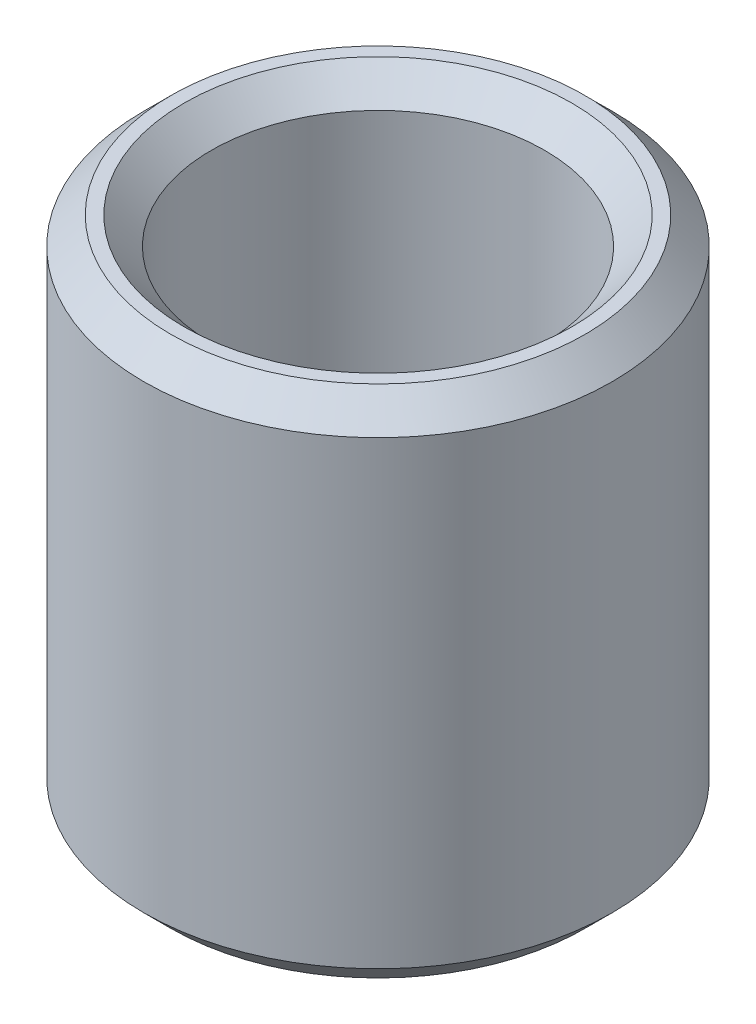
ISO-10303-21;
HEADER;
FILE_DESCRIPTION(('STEP AP214'),'2;1');
FILE_NAME('part.step','',(''),(''),'','','');
FILE_SCHEMA(('AUTOMOTIVE_DESIGN { 1 0 10303 214 1 1 1 1 }'));
ENDSEC;
DATA;
#1=APPLICATION_CONTEXT('core data for automotive mechanical design processes');
#2=APPLICATION_PROTOCOL_DEFINITION('international standard','automotive_design',2000,#1);
#3=PRODUCT_CONTEXT('',#1,'mechanical');
#4=PRODUCT('Part','Part','',(#3));
#5=PRODUCT_RELATED_PRODUCT_CATEGORY('part','',(#4));
#6=PRODUCT_DEFINITION_FORMATION('','',#4);
#7=PRODUCT_DEFINITION_CONTEXT('part definition',#1,'design');
#8=PRODUCT_DEFINITION('design','',#6,#7);
#9=PRODUCT_DEFINITION_SHAPE('','',#8);
#10=(LENGTH_UNIT() NAMED_UNIT(*) SI_UNIT(.MILLI.,.METRE.));
#11=(NAMED_UNIT(*) PLANE_ANGLE_UNIT() SI_UNIT($,.RADIAN.));
#12=(NAMED_UNIT(*) SI_UNIT($,.STERADIAN.) SOLID_ANGLE_UNIT());
#13=UNCERTAINTY_MEASURE_WITH_UNIT(LENGTH_MEASURE(1.E-05),#10,'distance_accuracy_value','');
#14=(GEOMETRIC_REPRESENTATION_CONTEXT(3) GLOBAL_UNCERTAINTY_ASSIGNED_CONTEXT((#13)) GLOBAL_UNIT_ASSIGNED_CONTEXT((#10,
#11,#12)) REPRESENTATION_CONTEXT('',''));
#15=CARTESIAN_POINT('',(0.,0.,0.));
#16=DIRECTION('',(0.,0.,1.));
#17=DIRECTION('',(1.,0.,0.));
#18=AXIS2_PLACEMENT_3D('',#15,#16,#17);
#19=CARTESIAN_POINT('',(0.,21.9595658767207,0.));
#20=DIRECTION('',(0.,-1.,0.));
#21=DIRECTION('',(0.,0.,-1.));
#22=AXIS2_PLACEMENT_3D('',#19,#20,#21);
#23=CYLINDRICAL_SURFACE('',#22,10.);
#24=CARTESIAN_POINT('',(0.,1.16347628392544,0.));
#25=DIRECTION('',(0.,1.,0.));
#26=DIRECTION('',(0.,0.,1.));
#27=AXIS2_PLACEMENT_3D('',#24,#25,#26);
#28=CIRCLE('',#27,10.);
#29=CARTESIAN_POINT('',(0.,1.16347628392544,10.));
#30=VERTEX_POINT('',#29);
#31=EDGE_CURVE('E10',#30,#30,#28,.T.);
#32=ORIENTED_EDGE('',*,*,#31,.T.);
#33=EDGE_LOOP('',(#32));
#34=FACE_BOUND('',#33,.T.);
#35=CARTESIAN_POINT('',(0.,20.7960895927952,0.));
#36=DIRECTION('',(0.,1.,0.));
#37=DIRECTION('',(0.,0.,1.));
#38=AXIS2_PLACEMENT_3D('',#35,#36,#37);
#39=CIRCLE('',#38,10.);
#40=CARTESIAN_POINT('',(0.,20.7960895927952,10.));
#41=VERTEX_POINT('',#40);
#42=EDGE_CURVE('E50',#41,#41,#39,.F.);
#43=ORIENTED_EDGE('',*,*,#42,.T.);
#44=EDGE_LOOP('',(#43));
#45=FACE_BOUND('',#44,.T.);
#46=ADVANCED_FACE('F39',(#34,#45),#23,.T.);
#47=CARTESIAN_POINT('',(0.,21.9595658767207,0.));
#48=DIRECTION('',(0.,1.,0.));
#49=DIRECTION('',(0.,0.,1.));
#50=AXIS2_PLACEMENT_3D('',#47,#48,#49);
#51=PLANE('',#50);
#52=CARTESIAN_POINT('',(0.,21.9595658767207,0.));
#53=DIRECTION('',(0.,1.,0.));
#54=DIRECTION('',(0.,0.,1.));
#55=AXIS2_PLACEMENT_3D('',#52,#53,#54);
#56=CIRCLE('',#55,8.27574237069555);
#57=CARTESIAN_POINT('',(0.,21.9595658767207,8.27574237069555));
#58=VERTEX_POINT('',#57);
#59=EDGE_CURVE('E58',#58,#58,#56,.F.);
#60=ORIENTED_EDGE('',*,*,#59,.T.);
#61=EDGE_LOOP('',(#60));
#62=FACE_BOUND('',#61,.T.);
#63=CARTESIAN_POINT('',(0.,21.9595658767207,0.));
#64=DIRECTION('',(0.,1.,0.));
#65=DIRECTION('',(0.,0.,1.));
#66=AXIS2_PLACEMENT_3D('',#63,#64,#65);
#67=CIRCLE('',#66,8.83652371607456);
#68=CARTESIAN_POINT('',(0.,21.9595658767207,8.83652371607456));
#69=VERTEX_POINT('',#68);
#70=EDGE_CURVE('E61',#69,#69,#67,.T.);
#71=ORIENTED_EDGE('',*,*,#70,.T.);
#72=EDGE_LOOP('',(#71));
#73=FACE_BOUND('',#72,.T.);
#74=ADVANCED_FACE('F88',(#62,#73),#51,.T.);
#75=CARTESIAN_POINT('',(0.,0.,0.));
#76=DIRECTION('',(0.,1.,0.));
#77=DIRECTION('',(0.,0.,1.));
#78=AXIS2_PLACEMENT_3D('',#75,#76,#77);
#79=PLANE('',#78);
#80=CARTESIAN_POINT('',(0.,0.,0.));
#81=DIRECTION('',(0.,1.,0.));
#82=DIRECTION('',(0.,0.,1.));
#83=AXIS2_PLACEMENT_3D('',#80,#81,#82);
#84=CIRCLE('',#83,8.27574237069554);
#85=CARTESIAN_POINT('',(0.,0.,8.27574237069554));
#86=VERTEX_POINT('',#85);
#87=EDGE_CURVE('E51',#86,#86,#84,.T.);
#88=ORIENTED_EDGE('',*,*,#87,.T.);
#89=EDGE_LOOP('',(#88));
#90=FACE_BOUND('',#89,.T.);
#91=CARTESIAN_POINT('',(0.,0.,0.));
#92=DIRECTION('',(0.,1.,0.));
#93=DIRECTION('',(0.,0.,1.));
#94=AXIS2_PLACEMENT_3D('',#91,#92,#93);
#95=CIRCLE('',#94,8.83652371607456);
#96=CARTESIAN_POINT('',(0.,0.,8.83652371607456));
#97=VERTEX_POINT('',#96);
#98=EDGE_CURVE('E54',#97,#97,#95,.F.);
#99=ORIENTED_EDGE('',*,*,#98,.T.);
#100=EDGE_LOOP('',(#99));
#101=FACE_BOUND('',#100,.T.);
#102=ADVANCED_FACE('F83',(#90,#101),#79,.F.);
#103=CARTESIAN_POINT('',(0.,21.9595658767207,0.));
#104=DIRECTION('',(0.,-1.,0.));
#105=DIRECTION('',(0.,0.,-1.));
#106=AXIS2_PLACEMENT_3D('',#103,#104,#105);
#107=CYLINDRICAL_SURFACE('',#106,7.11226608677011);
#108=CARTESIAN_POINT('',(0.,20.7960895927952,0.));
#109=DIRECTION('',(0.,1.,0.));
#110=DIRECTION('',(0.,0.,1.));
#111=AXIS2_PLACEMENT_3D('',#108,#109,#110);
#112=CIRCLE('',#111,7.11226608677011);
#113=CARTESIAN_POINT('',(0.,20.7960895927952,7.11226608677011));
#114=VERTEX_POINT('',#113);
#115=EDGE_CURVE('E67',#114,#114,#112,.T.);
#116=ORIENTED_EDGE('',*,*,#115,.T.);
#117=EDGE_LOOP('',(#116));
#118=FACE_BOUND('',#117,.T.);
#119=CARTESIAN_POINT('',(0.,1.16347628392544,0.));
#120=DIRECTION('',(0.,1.,0.));
#121=DIRECTION('',(0.,0.,1.));
#122=AXIS2_PLACEMENT_3D('',#119,#120,#121);
#123=CIRCLE('',#122,7.11226608677011);
#124=CARTESIAN_POINT('',(0.,1.16347628392544,7.11226608677011));
#125=VERTEX_POINT('',#124);
#126=EDGE_CURVE('E69',#125,#125,#123,.F.);
#127=ORIENTED_EDGE('',*,*,#126,.T.);
#128=EDGE_LOOP('',(#127));
#129=FACE_BOUND('',#128,.T.);
#130=ADVANCED_FACE('F71',(#118,#129),#107,.F.);
#131=CARTESIAN_POINT('',(0.,20.7960895927952,0.));
#132=DIRECTION('',(0.,1.,0.));
#133=DIRECTION('',(0.,0.,1.));
#134=AXIS2_PLACEMENT_3D('',#131,#132,#133);
#135=CONICAL_SURFACE('',#134,7.11226608677011,0.78539816339745);
#136=ORIENTED_EDGE('',*,*,#59,.F.);
#137=EDGE_LOOP('',(#136));
#138=FACE_BOUND('',#137,.T.);
#139=ORIENTED_EDGE('',*,*,#115,.F.);
#140=EDGE_LOOP('',(#139));
#141=FACE_BOUND('',#140,.T.);
#142=ADVANCED_FACE('F77',(#138,#141),#135,.F.);
#143=CARTESIAN_POINT('',(0.,0.,0.));
#144=DIRECTION('',(0.,-1.,0.));
#145=DIRECTION('',(0.,0.,-1.));
#146=AXIS2_PLACEMENT_3D('',#143,#144,#145);
#147=CONICAL_SURFACE('',#146,8.27574237069554,0.785398163397446);
#148=ORIENTED_EDGE('',*,*,#126,.F.);
#149=EDGE_LOOP('',(#148));
#150=FACE_BOUND('',#149,.T.);
#151=ORIENTED_EDGE('',*,*,#87,.F.);
#152=EDGE_LOOP('',(#151));
#153=FACE_BOUND('',#152,.T.);
#154=ADVANCED_FACE('F73',(#150,#153),#147,.F.);
#155=CARTESIAN_POINT('',(0.,1.16347628392544,0.));
#156=DIRECTION('',(0.,1.,0.));
#157=DIRECTION('',(0.,0.,1.));
#158=AXIS2_PLACEMENT_3D('',#155,#156,#157);
#159=CONICAL_SURFACE('',#158,10.,0.785398163397453);
#160=ORIENTED_EDGE('',*,*,#98,.F.);
#161=EDGE_LOOP('',(#160));
#162=FACE_BOUND('',#161,.T.);
#163=ORIENTED_EDGE('',*,*,#31,.F.);
#164=EDGE_LOOP('',(#163));
#165=FACE_BOUND('',#164,.T.);
#166=ADVANCED_FACE('F76',(#162,#165),#159,.T.);
#167=CARTESIAN_POINT('',(0.,21.9595658767207,0.));
#168=DIRECTION('',(0.,-1.,0.));
#169=DIRECTION('',(0.,0.,-1.));
#170=AXIS2_PLACEMENT_3D('',#167,#168,#169);
#171=CONICAL_SURFACE('',#170,8.83652371607456,0.785398163397444);
#172=ORIENTED_EDGE('',*,*,#42,.F.);
#173=EDGE_LOOP('',(#172));
#174=FACE_BOUND('',#173,.T.);
#175=ORIENTED_EDGE('',*,*,#70,.F.);
#176=EDGE_LOOP('',(#175));
#177=FACE_BOUND('',#176,.T.);
#178=ADVANCED_FACE('F45',(#174,#177),#171,.T.);
#179=CLOSED_SHELL('',(#46,#74,#102,#130,#142,#154,#166,#178));
#180=MANIFOLD_SOLID_BREP('B2',#179);
#181=ADVANCED_BREP_SHAPE_REPRESENTATION('',(#18,#180),#14);
#182=SHAPE_DEFINITION_REPRESENTATION(#9,#181);
ENDSEC;
END-ISO-10303-21;
